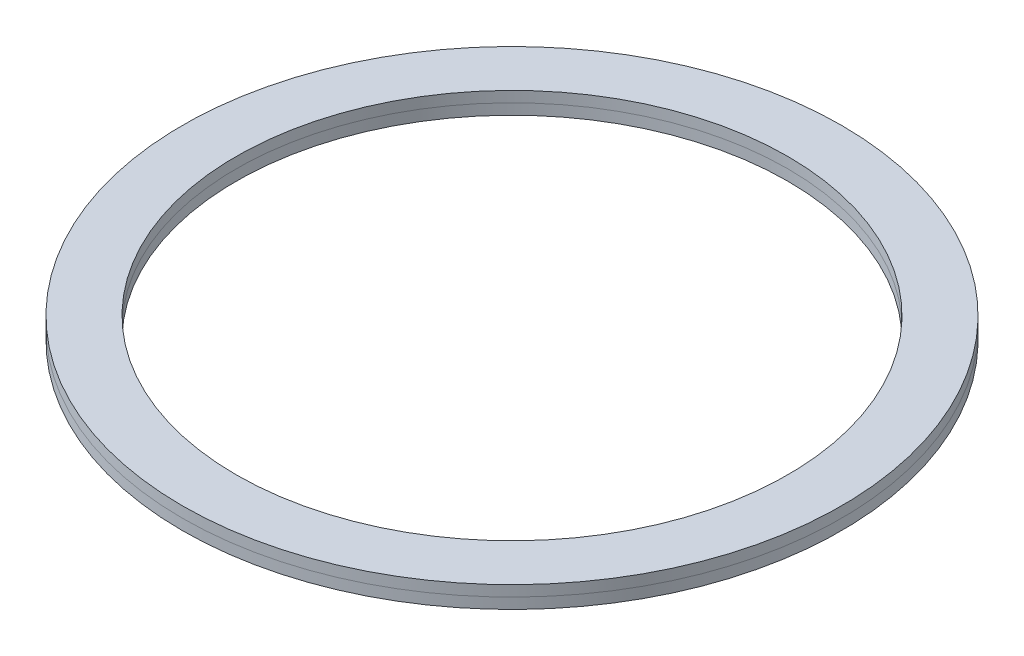
ISO-10303-21;
HEADER;
FILE_DESCRIPTION(('STEP AP214'),'2;1');
FILE_NAME('part.step','',(''),(''),'','','');
FILE_SCHEMA(('AUTOMOTIVE_DESIGN { 1 0 10303 214 1 1 1 1 }'));
ENDSEC;
DATA;
#1=APPLICATION_CONTEXT('core data for automotive mechanical design processes');
#2=APPLICATION_PROTOCOL_DEFINITION('international standard','automotive_design',2000,#1);
#3=PRODUCT_CONTEXT('',#1,'mechanical');
#4=PRODUCT('Part','Part','',(#3));
#5=PRODUCT_RELATED_PRODUCT_CATEGORY('part','',(#4));
#6=PRODUCT_DEFINITION_FORMATION('','',#4);
#7=PRODUCT_DEFINITION_CONTEXT('part definition',#1,'design');
#8=PRODUCT_DEFINITION('design','',#6,#7);
#9=PRODUCT_DEFINITION_SHAPE('','',#8);
#10=(LENGTH_UNIT() NAMED_UNIT(*) SI_UNIT(.MILLI.,.METRE.));
#11=(NAMED_UNIT(*) PLANE_ANGLE_UNIT() SI_UNIT($,.RADIAN.));
#12=(NAMED_UNIT(*) SI_UNIT($,.STERADIAN.) SOLID_ANGLE_UNIT());
#13=UNCERTAINTY_MEASURE_WITH_UNIT(LENGTH_MEASURE(1.E-05),#10,'distance_accuracy_value','');
#14=(GEOMETRIC_REPRESENTATION_CONTEXT(3) GLOBAL_UNCERTAINTY_ASSIGNED_CONTEXT((#13)) GLOBAL_UNIT_ASSIGNED_CONTEXT((#10,
#11,#12)) REPRESENTATION_CONTEXT('',''));
#15=CARTESIAN_POINT('',(0.,0.,0.));
#16=DIRECTION('',(0.,0.,1.));
#17=DIRECTION('',(1.,0.,0.));
#18=AXIS2_PLACEMENT_3D('',#15,#16,#17);
#19=CARTESIAN_POINT('',(0.,1.,0.));
#20=DIRECTION('',(0.,1.,0.));
#21=DIRECTION('',(0.,0.,1.));
#22=AXIS2_PLACEMENT_3D('',#19,#20,#21);
#23=PLANE('',#22);
#24=CARTESIAN_POINT('',(0.,1.,0.));
#25=DIRECTION('',(0.,1.,0.));
#26=DIRECTION('',(0.,0.,1.));
#27=AXIS2_PLACEMENT_3D('',#24,#25,#26);
#28=CIRCLE('',#27,30.65);
#29=CARTESIAN_POINT('',(0.,1.,30.65));
#30=VERTEX_POINT('',#29);
#31=EDGE_CURVE('E57',#30,#30,#28,.T.);
#32=ORIENTED_EDGE('',*,*,#31,.T.);
#33=EDGE_LOOP('',(#32));
#34=FACE_BOUND('',#33,.T.);
#35=CARTESIAN_POINT('',(0.,1.,0.));
#36=DIRECTION('',(0.,1.,0.));
#37=DIRECTION('',(0.,0.,1.));
#38=AXIS2_PLACEMENT_3D('',#35,#36,#37);
#39=CIRCLE('',#38,25.65);
#40=CARTESIAN_POINT('',(0.,1.,25.65));
#41=VERTEX_POINT('',#40);
#42=EDGE_CURVE('E48',#41,#41,#39,.F.);
#43=ORIENTED_EDGE('',*,*,#42,.T.);
#44=EDGE_LOOP('',(#43));
#45=FACE_BOUND('',#44,.T.);
#46=ADVANCED_FACE('F44',(#34,#45),#23,.T.);
#47=CARTESIAN_POINT('',(0.,0.,0.));
#48=DIRECTION('',(0.,-1.,0.));
#49=DIRECTION('',(0.,0.,-1.));
#50=AXIS2_PLACEMENT_3D('',#47,#48,#49);
#51=CYLINDRICAL_SURFACE('',#50,30.65);
#52=CARTESIAN_POINT('',(0.,0.,0.));
#53=DIRECTION('',(0.,-1.,0.));
#54=DIRECTION('',(0.,0.,-1.));
#55=AXIS2_PLACEMENT_3D('',#52,#53,#54);
#56=CIRCLE('',#55,30.65);
#57=CARTESIAN_POINT('',(0.,0.,-30.65));
#58=VERTEX_POINT('',#57);
#59=EDGE_CURVE('E12',#58,#58,#56,.T.);
#60=ORIENTED_EDGE('',*,*,#59,.F.);
#61=EDGE_LOOP('',(#60));
#62=FACE_BOUND('',#61,.T.);
#63=ORIENTED_EDGE('',*,*,#31,.F.);
#64=EDGE_LOOP('',(#63));
#65=FACE_BOUND('',#64,.T.);
#66=ADVANCED_FACE('F46',(#62,#65),#51,.T.);
#67=CARTESIAN_POINT('',(0.,0.,0.));
#68=DIRECTION('',(0.,-1.,0.));
#69=DIRECTION('',(0.,0.,-1.));
#70=AXIS2_PLACEMENT_3D('',#67,#68,#69);
#71=CYLINDRICAL_SURFACE('',#70,25.65);
#72=CARTESIAN_POINT('',(0.,0.,0.));
#73=DIRECTION('',(0.,-1.,0.));
#74=DIRECTION('',(0.,0.,-1.));
#75=AXIS2_PLACEMENT_3D('',#72,#73,#74);
#76=CIRCLE('',#75,25.65);
#77=CARTESIAN_POINT('',(0.,0.,-25.65));
#78=VERTEX_POINT('',#77);
#79=EDGE_CURVE('E52',#78,#78,#76,.T.);
#80=ORIENTED_EDGE('',*,*,#79,.T.);
#81=EDGE_LOOP('',(#80));
#82=FACE_BOUND('',#81,.T.);
#83=ORIENTED_EDGE('',*,*,#42,.F.);
#84=EDGE_LOOP('',(#83));
#85=FACE_BOUND('',#84,.T.);
#86=ADVANCED_FACE('F66',(#82,#85),#71,.F.);
#87=CARTESIAN_POINT('',(-30.65,0.,0.));
#88=DIRECTION('',(0.,1.,0.));
#89=DIRECTION('',(0.,0.,1.));
#90=AXIS2_PLACEMENT_3D('',#87,#88,#89);
#91=PLANE('',#90);
#92=ORIENTED_EDGE('',*,*,#79,.F.);
#93=EDGE_LOOP('',(#92));
#94=FACE_BOUND('',#93,.T.);
#95=ORIENTED_EDGE('',*,*,#59,.T.);
#96=EDGE_LOOP('',(#95));
#97=FACE_BOUND('',#96,.T.);
#98=ADVANCED_FACE('F68',(#94,#97),#91,.F.);
#99=CLOSED_SHELL('',(#46,#66,#86,#98));
#100=MANIFOLD_SOLID_BREP('B2',#99);
#101=CARTESIAN_POINT('',(0.,1.,0.));
#102=DIRECTION('',(0.,1.,0.));
#103=DIRECTION('',(0.,0.,1.));
#104=AXIS2_PLACEMENT_3D('',#101,#102,#103);
#105=PLANE('',#104);
#106=CARTESIAN_POINT('',(0.,1.,0.));
#107=DIRECTION('',(0.,1.,0.));
#108=DIRECTION('',(0.,0.,1.));
#109=AXIS2_PLACEMENT_3D('',#106,#107,#108);
#110=CIRCLE('',#109,25.65);
#111=CARTESIAN_POINT('',(0.,1.,25.65));
#112=VERTEX_POINT('',#111);
#113=EDGE_CURVE('E112',#112,#112,#110,.F.);
#114=ORIENTED_EDGE('',*,*,#113,.F.);
#115=EDGE_LOOP('',(#114));
#116=FACE_BOUND('',#115,.T.);
#117=CARTESIAN_POINT('',(0.,1.,0.));
#118=DIRECTION('',(0.,1.,0.));
#119=DIRECTION('',(0.,0.,1.));
#120=AXIS2_PLACEMENT_3D('',#117,#118,#119);
#121=CIRCLE('',#120,30.65);
#122=CARTESIAN_POINT('',(0.,1.,30.65));
#123=VERTEX_POINT('',#122);
#124=EDGE_CURVE('E43',#123,#123,#121,.T.);
#125=ORIENTED_EDGE('',*,*,#124,.F.);
#126=EDGE_LOOP('',(#125));
#127=FACE_BOUND('',#126,.T.);
#128=ADVANCED_FACE('F106',(#116,#127),#105,.F.);
#129=CARTESIAN_POINT('',(-30.65,2.,0.));
#130=DIRECTION('',(0.,-1.,0.));
#131=DIRECTION('',(0.,0.,-1.));
#132=AXIS2_PLACEMENT_3D('',#129,#130,#131);
#133=PLANE('',#132);
#134=CARTESIAN_POINT('',(0.,2.,0.));
#135=DIRECTION('',(0.,-1.,0.));
#136=DIRECTION('',(0.,0.,-1.));
#137=AXIS2_PLACEMENT_3D('',#134,#135,#136);
#138=CIRCLE('',#137,30.65);
#139=CARTESIAN_POINT('',(0.,2.,-30.65));
#140=VERTEX_POINT('',#139);
#141=EDGE_CURVE('E116',#140,#140,#138,.T.);
#142=ORIENTED_EDGE('',*,*,#141,.F.);
#143=EDGE_LOOP('',(#142));
#144=FACE_BOUND('',#143,.T.);
#145=CARTESIAN_POINT('',(0.,2.,0.));
#146=DIRECTION('',(0.,-1.,0.));
#147=DIRECTION('',(0.,0.,-1.));
#148=AXIS2_PLACEMENT_3D('',#145,#146,#147);
#149=CIRCLE('',#148,25.65);
#150=CARTESIAN_POINT('',(0.,2.,-25.65));
#151=VERTEX_POINT('',#150);
#152=EDGE_CURVE('E120',#151,#151,#149,.T.);
#153=ORIENTED_EDGE('',*,*,#152,.T.);
#154=EDGE_LOOP('',(#153));
#155=FACE_BOUND('',#154,.T.);
#156=ADVANCED_FACE('F126',(#144,#155),#133,.F.);
#157=CARTESIAN_POINT('',(0.,0.,0.));
#158=DIRECTION('',(0.,-1.,0.));
#159=DIRECTION('',(0.,0.,-1.));
#160=AXIS2_PLACEMENT_3D('',#157,#158,#159);
#161=CYLINDRICAL_SURFACE('',#160,25.65);
#162=ORIENTED_EDGE('',*,*,#113,.T.);
#163=EDGE_LOOP('',(#162));
#164=FACE_BOUND('',#163,.T.);
#165=ORIENTED_EDGE('',*,*,#152,.F.);
#166=EDGE_LOOP('',(#165));
#167=FACE_BOUND('',#166,.T.);
#168=ADVANCED_FACE('F128',(#164,#167),#161,.F.);
#169=CARTESIAN_POINT('',(0.,0.,0.));
#170=DIRECTION('',(0.,-1.,0.));
#171=DIRECTION('',(0.,0.,-1.));
#172=AXIS2_PLACEMENT_3D('',#169,#170,#171);
#173=CYLINDRICAL_SURFACE('',#172,30.65);
#174=ORIENTED_EDGE('',*,*,#124,.T.);
#175=EDGE_LOOP('',(#174));
#176=FACE_BOUND('',#175,.T.);
#177=ORIENTED_EDGE('',*,*,#141,.T.);
#178=EDGE_LOOP('',(#177));
#179=FACE_BOUND('',#178,.T.);
#180=ADVANCED_FACE('F130',(#176,#179),#173,.T.);
#181=CLOSED_SHELL('',(#128,#156,#168,#180));
#182=MANIFOLD_SOLID_BREP('B7',#181);
#183=ADVANCED_BREP_SHAPE_REPRESENTATION('',(#18,#100,#182),#14);
#184=SHAPE_DEFINITION_REPRESENTATION(#9,#183);
ENDSEC;
END-ISO-10303-21;
